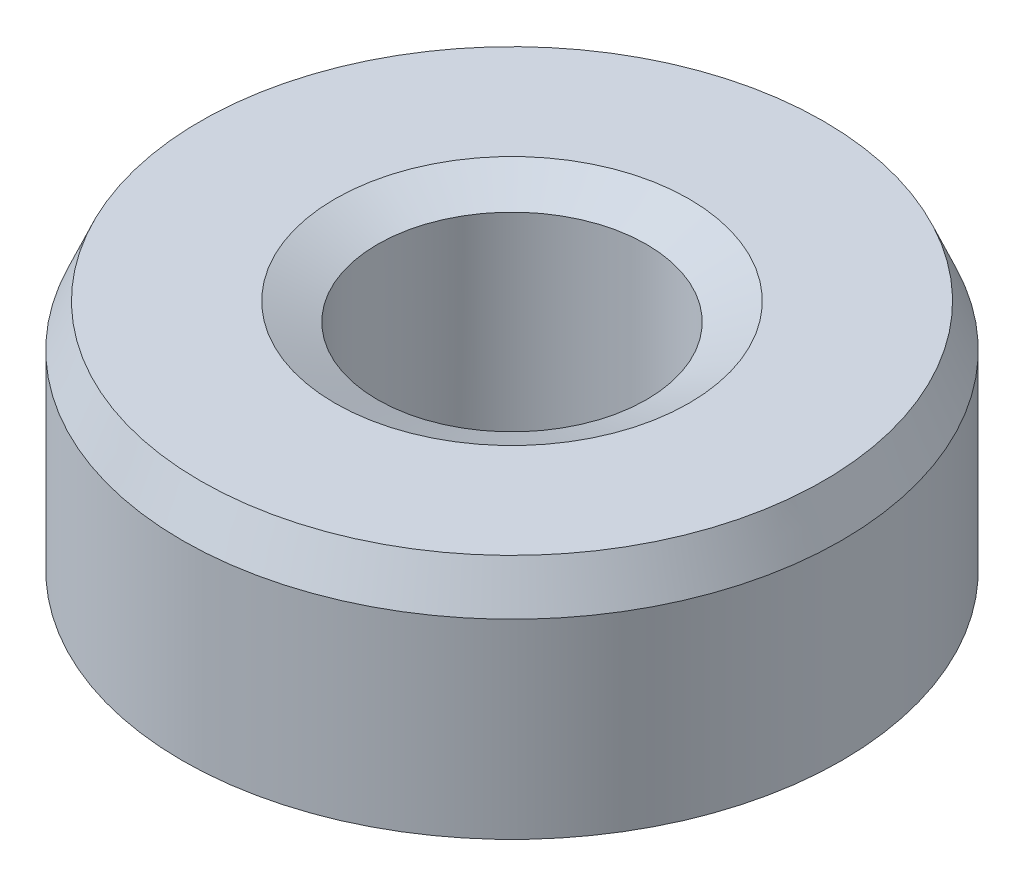
ISO-10303-21;
HEADER;
FILE_DESCRIPTION(('STEP AP214'),'2;1');
FILE_NAME('part.step','',(''),(''),'','','');
FILE_SCHEMA(('AUTOMOTIVE_DESIGN { 1 0 10303 214 1 1 1 1 }'));
ENDSEC;
DATA;
#1=APPLICATION_CONTEXT('core data for automotive mechanical design processes');
#2=APPLICATION_PROTOCOL_DEFINITION('international standard','automotive_design',2000,#1);
#3=PRODUCT_CONTEXT('',#1,'mechanical');
#4=PRODUCT('Part','Part','',(#3));
#5=PRODUCT_RELATED_PRODUCT_CATEGORY('part','',(#4));
#6=PRODUCT_DEFINITION_FORMATION('','',#4);
#7=PRODUCT_DEFINITION_CONTEXT('part definition',#1,'design');
#8=PRODUCT_DEFINITION('design','',#6,#7);
#9=PRODUCT_DEFINITION_SHAPE('','',#8);
#10=(LENGTH_UNIT() NAMED_UNIT(*) SI_UNIT(.MILLI.,.METRE.));
#11=(NAMED_UNIT(*) PLANE_ANGLE_UNIT() SI_UNIT($,.RADIAN.));
#12=(NAMED_UNIT(*) SI_UNIT($,.STERADIAN.) SOLID_ANGLE_UNIT());
#13=UNCERTAINTY_MEASURE_WITH_UNIT(LENGTH_MEASURE(1.E-05),#10,'distance_accuracy_value','');
#14=(GEOMETRIC_REPRESENTATION_CONTEXT(3) GLOBAL_UNCERTAINTY_ASSIGNED_CONTEXT((#13)) GLOBAL_UNIT_ASSIGNED_CONTEXT((#10,
#11,#12)) REPRESENTATION_CONTEXT('',''));
#15=CARTESIAN_POINT('',(0.,0.,0.));
#16=DIRECTION('',(0.,0.,1.));
#17=DIRECTION('',(1.,0.,0.));
#18=AXIS2_PLACEMENT_3D('',#15,#16,#17);
#19=CARTESIAN_POINT('',(0.,5.71659606913814,0.));
#20=DIRECTION('',(0.,-1.,0.));
#21=DIRECTION('',(0.,0.,-1.));
#22=AXIS2_PLACEMENT_3D('',#19,#20,#21);
#23=CYLINDRICAL_SURFACE('',#22,7.5);
#24=CARTESIAN_POINT('',(0.,0.412879435065678,0.));
#25=DIRECTION('',(0.,1.,0.));
#26=DIRECTION('',(0.,0.,1.));
#27=AXIS2_PLACEMENT_3D('',#24,#25,#26);
#28=CIRCLE('',#27,7.5);
#29=CARTESIAN_POINT('',(0.,0.412879435065678,-7.5));
#30=VERTEX_POINT('',#29);
#31=EDGE_CURVE('E10',#30,#30,#28,.T.);
#32=CARTESIAN_POINT('',(0.,4.75047972856687,0.));
#33=DIRECTION('',(0.,1.,0.));
#34=DIRECTION('',(0.,0.,1.));
#35=AXIS2_PLACEMENT_3D('',#32,#33,#34);
#36=CIRCLE('',#35,7.5);
#37=CARTESIAN_POINT('',(0.,4.75047972856687,-7.5));
#38=VERTEX_POINT('',#37);
#39=EDGE_CURVE('E50',#38,#38,#36,.F.);
#40=CARTESIAN_POINT('',(0.,0.412879435065678,-7.5));
#41=CARTESIAN_POINT('',(0.,0.458062771456315,-7.5));
#42=CARTESIAN_POINT('',(0.,0.503246107846952,-7.5));
#43=CARTESIAN_POINT('',(0.,0.593612780628227,-7.5));
#44=CARTESIAN_POINT('',(0.,0.638796117018865,-7.5));
#45=CARTESIAN_POINT('',(0.,0.72916278980014,-7.5));
#46=CARTESIAN_POINT('',(0.,0.774346126190777,-7.5));
#47=CARTESIAN_POINT('',(0.,0.864712798972052,-7.5));
#48=CARTESIAN_POINT('',(0.,0.909896135362689,-7.5));
#49=CARTESIAN_POINT('',(0.,1.00026280814396,-7.5));
#50=CARTESIAN_POINT('',(0.,1.0454461445346,-7.5));
#51=CARTESIAN_POINT('',(0.,1.13581281731588,-7.5));
#52=CARTESIAN_POINT('',(0.,1.18099615370651,-7.5));
#53=CARTESIAN_POINT('',(0.,1.27136282648779,-7.5));
#54=CARTESIAN_POINT('',(0.,1.31654616287843,-7.5));
#55=CARTESIAN_POINT('',(0.,1.4069128356597,-7.5));
#56=CARTESIAN_POINT('',(0.,1.45209617205034,-7.5));
#57=CARTESIAN_POINT('',(0.,1.54246284483161,-7.5));
#58=CARTESIAN_POINT('',(0.,1.58764618122225,-7.5));
#59=CARTESIAN_POINT('',(0.,1.67801285400352,-7.5));
#60=CARTESIAN_POINT('',(0.,1.72319619039416,-7.5));
#61=CARTESIAN_POINT('',(0.,1.81356286317544,-7.5));
#62=CARTESIAN_POINT('',(0.,1.85874619956607,-7.5));
#63=CARTESIAN_POINT('',(0.,1.94911287234735,-7.5));
#64=CARTESIAN_POINT('',(0.,1.99429620873799,-7.5));
#65=CARTESIAN_POINT('',(0.,2.08466288151926,-7.5));
#66=CARTESIAN_POINT('',(0.,2.1298462179099,-7.5));
#67=CARTESIAN_POINT('',(0.,2.22021289069117,-7.5));
#68=CARTESIAN_POINT('',(0.,2.26539622708181,-7.5));
#69=CARTESIAN_POINT('',(0.,2.35576289986308,-7.5));
#70=CARTESIAN_POINT('',(0.,2.40094623625372,-7.5));
#71=CARTESIAN_POINT('',(0.,2.491312909035,-7.5));
#72=CARTESIAN_POINT('',(0.,2.53649624542563,-7.5));
#73=CARTESIAN_POINT('',(0.,2.62686291820691,-7.5));
#74=CARTESIAN_POINT('',(0.,2.67204625459755,-7.5));
#75=CARTESIAN_POINT('',(0.,2.76241292737882,-7.5));
#76=CARTESIAN_POINT('',(0.,2.80759626376946,-7.5));
#77=CARTESIAN_POINT('',(0.,2.89796293655073,-7.5));
#78=CARTESIAN_POINT('',(0.,2.94314627294137,-7.5));
#79=CARTESIAN_POINT('',(0.,3.03351294572265,-7.5));
#80=CARTESIAN_POINT('',(0.,3.07869628211328,-7.5));
#81=CARTESIAN_POINT('',(0.,3.16906295489456,-7.5));
#82=CARTESIAN_POINT('',(0.,3.2142462912852,-7.5));
#83=CARTESIAN_POINT('',(0.,3.30461296406647,-7.5));
#84=CARTESIAN_POINT('',(0.,3.34979630045711,-7.5));
#85=CARTESIAN_POINT('',(0.,3.44016297323838,-7.5));
#86=CARTESIAN_POINT('',(0.,3.48534630962902,-7.5));
#87=CARTESIAN_POINT('',(0.,3.57571298241029,-7.5));
#88=CARTESIAN_POINT('',(0.,3.62089631880093,-7.5));
#89=CARTESIAN_POINT('',(0.,3.71126299158221,-7.5));
#90=CARTESIAN_POINT('',(0.,3.75644632797284,-7.5));
#91=CARTESIAN_POINT('',(0.,3.84681300075412,-7.5));
#92=CARTESIAN_POINT('',(0.,3.89199633714476,-7.5));
#93=CARTESIAN_POINT('',(0.,3.98236300992603,-7.5));
#94=CARTESIAN_POINT('',(0.,4.02754634631667,-7.5));
#95=CARTESIAN_POINT('',(0.,4.11791301909794,-7.5));
#96=CARTESIAN_POINT('',(0.,4.16309635548858,-7.5));
#97=CARTESIAN_POINT('',(0.,4.25346302826985,-7.5));
#98=CARTESIAN_POINT('',(0.,4.29864636466049,-7.5));
#99=CARTESIAN_POINT('',(0.,4.38901303744177,-7.5));
#100=CARTESIAN_POINT('',(0.,4.4341963738324,-7.5));
#101=CARTESIAN_POINT('',(0.,4.52456304661368,-7.5));
#102=CARTESIAN_POINT('',(0.,4.56974638300432,-7.5));
#103=CARTESIAN_POINT('',(0.,4.66011305578559,-7.5));
#104=CARTESIAN_POINT('',(0.,4.70529639217623,-7.5));
#105=CARTESIAN_POINT('',(0.,4.75047972856687,-7.5));
#106=B_SPLINE_CURVE_WITH_KNOTS('',3,(#40,#41,#42,#43,#44,#45,#46,#47,#48,#49,#50,#51,#52,#53,
#54,#55,#56,#57,#58,#59,#60,#61,#62,#63,#64,#65,#66,#67,#68,#69,#70,#71,#72,#73,#74,#75,#76,#77,
#78,#79,#80,#81,#82,#83,#84,#85,#86,#87,#88,#89,#90,#91,#92,#93,#94,#95,#96,#97,#98,#99,#100,
#101,#102,#103,#104,#105),.UNSPECIFIED.,.F.,.F.,(4,2,2,2,2,2,2,2,2,2,2,2,2,2,2,2,2,2,2,2,2,2,2,
2,2,2,2,2,2,2,2,2,4),(0.,0.135550009171912,0.271100018343825,0.406650027515737,
0.542200036687649,0.67775004585956,0.813300055031473,0.948850064203385,1.0844000733753,
1.21995008254721,1.35550009171912,1.49105010089103,1.62660011006295,1.76215011923486,
1.89770012840677,2.03325013757868,2.16880014675059,2.30435015592251,2.43990016509442,
2.57545017426633,2.71100018343824,2.84655019261016,2.98210020178207,3.11765021095398,
3.25320022012589,3.3887502292978,3.52430023846972,3.65985024764163,3.79540025681354,
3.93095026598545,4.06650027515736,4.20205028432928,4.33760029350119),.UNSPECIFIED.);
#107=EDGE_CURVE('BSEAM39',#30,#38,#106,.T.);
#108=ORIENTED_EDGE('',*,*,#31,.T.);
#109=ORIENTED_EDGE('',*,*,#39,.T.);
#110=ORIENTED_EDGE('',*,*,#107,.T.);
#111=ORIENTED_EDGE('',*,*,#107,.F.);
#112=EDGE_LOOP('',(#108,#110,#109,#111));
#113=FACE_BOUND('',#112,.T.);
#114=ADVANCED_FACE('F39',(#113),#23,.T.);
#115=CARTESIAN_POINT('',(0.,5.71659606913814,0.));
#116=DIRECTION('',(0.,1.,0.));
#117=DIRECTION('',(0.,0.,1.));
#118=AXIS2_PLACEMENT_3D('',#115,#116,#117);
#119=PLANE('',#118);
#120=CARTESIAN_POINT('',(0.,5.71659606913814,0.));
#121=DIRECTION('',(0.,1.,0.));
#122=DIRECTION('',(0.,0.,1.));
#123=AXIS2_PLACEMENT_3D('',#120,#121,#122);
#124=CIRCLE('',#123,4.02668549359805);
#125=CARTESIAN_POINT('',(0.,5.71659606913814,4.02668549359805));
#126=VERTEX_POINT('',#125);
#127=EDGE_CURVE('E58',#126,#126,#124,.F.);
#128=ORIENTED_EDGE('',*,*,#127,.T.);
#129=EDGE_LOOP('',(#128));
#130=FACE_BOUND('',#129,.T.);
#131=CARTESIAN_POINT('',(0.,5.71659606913814,0.));
#132=DIRECTION('',(0.,1.,0.));
#133=DIRECTION('',(0.,0.,1.));
#134=AXIS2_PLACEMENT_3D('',#131,#132,#133);
#135=CIRCLE('',#134,7.08712056493434);
#136=CARTESIAN_POINT('',(0.,5.71659606913814,7.08712056493434));
#137=VERTEX_POINT('',#136);
#138=EDGE_CURVE('E61',#137,#137,#135,.T.);
#139=ORIENTED_EDGE('',*,*,#138,.T.);
#140=EDGE_LOOP('',(#139));
#141=FACE_BOUND('',#140,.T.);
#142=ADVANCED_FACE('F88',(#130,#141),#119,.T.);
#143=CARTESIAN_POINT('',(0.,0.,0.));
#144=DIRECTION('',(0.,1.,0.));
#145=DIRECTION('',(0.,0.,1.));
#146=AXIS2_PLACEMENT_3D('',#143,#144,#145);
#147=PLANE('',#146);
#148=CARTESIAN_POINT('',(0.,0.,0.));
#149=DIRECTION('',(0.,1.,0.));
#150=DIRECTION('',(0.,0.,1.));
#151=AXIS2_PLACEMENT_3D('',#148,#149,#150);
#152=CIRCLE('',#151,3.47344858809238);
#153=CARTESIAN_POINT('',(0.,0.,3.47344858809238));
#154=VERTEX_POINT('',#153);
#155=EDGE_CURVE('E51',#154,#154,#152,.T.);
#156=ORIENTED_EDGE('',*,*,#155,.T.);
#157=EDGE_LOOP('',(#156));
#158=FACE_BOUND('',#157,.T.);
#159=CARTESIAN_POINT('',(0.,0.,0.));
#160=DIRECTION('',(0.,1.,0.));
#161=DIRECTION('',(0.,0.,1.));
#162=AXIS2_PLACEMENT_3D('',#159,#160,#161);
#163=CIRCLE('',#162,6.53388365942867);
#164=CARTESIAN_POINT('',(0.,0.,6.53388365942867));
#165=VERTEX_POINT('',#164);
#166=EDGE_CURVE('E54',#165,#165,#163,.F.);
#167=ORIENTED_EDGE('',*,*,#166,.T.);
#168=EDGE_LOOP('',(#167));
#169=FACE_BOUND('',#168,.T.);
#170=ADVANCED_FACE('F83',(#158,#169),#147,.F.);
#171=CARTESIAN_POINT('',(0.,5.71659606913814,0.));
#172=DIRECTION('',(0.,-1.,0.));
#173=DIRECTION('',(0.,0.,-1.));
#174=AXIS2_PLACEMENT_3D('',#171,#172,#173);
#175=CYLINDRICAL_SURFACE('',#174,3.06056915302673);
#176=CARTESIAN_POINT('',(0.,5.30371663407246,0.));
#177=DIRECTION('',(0.,1.,0.));
#178=DIRECTION('',(0.,0.,1.));
#179=AXIS2_PLACEMENT_3D('',#176,#177,#178);
#180=CIRCLE('',#179,3.06056915302673);
#181=CARTESIAN_POINT('',(0.,5.30371663407246,-3.06056915302673));
#182=VERTEX_POINT('',#181);
#183=EDGE_CURVE('E67',#182,#182,#180,.T.);
#184=CARTESIAN_POINT('',(0.,0.966116340571286,0.));
#185=DIRECTION('',(0.,1.,0.));
#186=DIRECTION('',(0.,0.,1.));
#187=AXIS2_PLACEMENT_3D('',#184,#185,#186);
#188=CIRCLE('',#187,3.06056915302673);
#189=CARTESIAN_POINT('',(0.,0.966116340571286,-3.06056915302673));
#190=VERTEX_POINT('',#189);
#191=EDGE_CURVE('E69',#190,#190,#188,.F.);
#192=CARTESIAN_POINT('',(0.,5.30371663407246,-3.06056915302673));
#193=CARTESIAN_POINT('',(0.,5.25853329768182,-3.06056915302673));
#194=CARTESIAN_POINT('',(0.,5.21334996129119,-3.06056915302673));
#195=CARTESIAN_POINT('',(0.,5.12298328850991,-3.06056915302673));
#196=CARTESIAN_POINT('',(0.,5.07779995211927,-3.06056915302673));
#197=CARTESIAN_POINT('',(0.,4.987433279338,-3.06056915302673));
#198=CARTESIAN_POINT('',(0.,4.94224994294736,-3.06056915302673));
#199=CARTESIAN_POINT('',(0.,4.85188327016609,-3.06056915302673));
#200=CARTESIAN_POINT('',(0.,4.80669993377545,-3.06056915302673));
#201=CARTESIAN_POINT('',(0.,4.71633326099418,-3.06056915302673));
#202=CARTESIAN_POINT('',(0.,4.67114992460354,-3.06056915302673));
#203=CARTESIAN_POINT('',(0.,4.58078325182226,-3.06056915302673));
#204=CARTESIAN_POINT('',(0.,4.53559991543163,-3.06056915302673));
#205=CARTESIAN_POINT('',(0.,4.44523324265035,-3.06056915302673));
#206=CARTESIAN_POINT('',(0.,4.40004990625972,-3.06056915302673));
#207=CARTESIAN_POINT('',(0.,4.30968323347844,-3.06056915302673));
#208=CARTESIAN_POINT('',(0.,4.2644998970878,-3.06056915302673));
#209=CARTESIAN_POINT('',(0.,4.17413322430653,-3.06056915302673));
#210=CARTESIAN_POINT('',(0.,4.12894988791589,-3.06056915302673));
#211=CARTESIAN_POINT('',(0.,4.03858321513462,-3.06056915302673));
#212=CARTESIAN_POINT('',(0.,3.99339987874398,-3.06056915302673));
#213=CARTESIAN_POINT('',(0.,3.90303320596271,-3.06056915302673));
#214=CARTESIAN_POINT('',(0.,3.85784986957207,-3.06056915302673));
#215=CARTESIAN_POINT('',(0.,3.76748319679079,-3.06056915302673));
#216=CARTESIAN_POINT('',(0.,3.72229986040016,-3.06056915302673));
#217=CARTESIAN_POINT('',(0.,3.63193318761888,-3.06056915302673));
#218=CARTESIAN_POINT('',(0.,3.58674985122825,-3.06056915302673));
#219=CARTESIAN_POINT('',(0.,3.49638317844697,-3.06056915302673));
#220=CARTESIAN_POINT('',(0.,3.45119984205633,-3.06056915302673));
#221=CARTESIAN_POINT('',(0.,3.36083316927506,-3.06056915302673));
#222=CARTESIAN_POINT('',(0.,3.31564983288442,-3.06056915302673));
#223=CARTESIAN_POINT('',(0.,3.22528316010315,-3.06056915302673));
#224=CARTESIAN_POINT('',(0.,3.18009982371251,-3.06056915302673));
#225=CARTESIAN_POINT('',(0.,3.08973315093124,-3.06056915302673));
#226=CARTESIAN_POINT('',(0.,3.0445498145406,-3.06056915302673));
#227=CARTESIAN_POINT('',(0.,2.95418314175932,-3.06056915302673));
#228=CARTESIAN_POINT('',(0.,2.90899980536869,-3.06056915302673));
#229=CARTESIAN_POINT('',(0.,2.81863313258741,-3.06056915302673));
#230=CARTESIAN_POINT('',(0.,2.77344979619677,-3.06056915302673));
#231=CARTESIAN_POINT('',(0.,2.6830831234155,-3.06056915302673));
#232=CARTESIAN_POINT('',(0.,2.63789978702486,-3.06056915302673));
#233=CARTESIAN_POINT('',(0.,2.54753311424359,-3.06056915302673));
#234=CARTESIAN_POINT('',(0.,2.50234977785295,-3.06056915302673));
#235=CARTESIAN_POINT('',(0.,2.41198310507168,-3.06056915302673));
#236=CARTESIAN_POINT('',(0.,2.36679976868104,-3.06056915302673));
#237=CARTESIAN_POINT('',(0.,2.27643309589976,-3.06056915302673));
#238=CARTESIAN_POINT('',(0.,2.23124975950913,-3.06056915302673));
#239=CARTESIAN_POINT('',(0.,2.14088308672785,-3.06056915302673));
#240=CARTESIAN_POINT('',(0.,2.09569975033722,-3.06056915302673));
#241=CARTESIAN_POINT('',(0.,2.00533307755594,-3.06056915302673));
#242=CARTESIAN_POINT('',(0.,1.9601497411653,-3.06056915302673));
#243=CARTESIAN_POINT('',(0.,1.86978306838403,-3.06056915302673));
#244=CARTESIAN_POINT('',(0.,1.82459973199339,-3.06056915302673));
#245=CARTESIAN_POINT('',(0.,1.73423305921212,-3.06056915302673));
#246=CARTESIAN_POINT('',(0.,1.68904972282148,-3.06056915302673));
#247=CARTESIAN_POINT('',(0.,1.59868305004021,-3.06056915302673));
#248=CARTESIAN_POINT('',(0.,1.55349971364957,-3.06056915302673));
#249=CARTESIAN_POINT('',(0.,1.46313304086829,-3.06056915302673));
#250=CARTESIAN_POINT('',(0.,1.41794970447766,-3.06056915302673));
#251=CARTESIAN_POINT('',(0.,1.32758303169638,-3.06056915302673));
#252=CARTESIAN_POINT('',(0.,1.28239969530575,-3.06056915302673));
#253=CARTESIAN_POINT('',(0.,1.19203302252447,-3.06056915302673));
#254=CARTESIAN_POINT('',(0.,1.14684968613383,-3.06056915302673));
#255=CARTESIAN_POINT('',(0.,1.05648301335256,-3.06056915302673));
#256=CARTESIAN_POINT('',(0.,1.01129967696192,-3.06056915302673));
#257=CARTESIAN_POINT('',(0.,0.966116340571286,-3.06056915302673));
#258=B_SPLINE_CURVE_WITH_KNOTS('',3,(#192,#193,#194,#195,#196,#197,#198,#199,#200,#201,#202,
#203,#204,#205,#206,#207,#208,#209,#210,#211,#212,#213,#214,#215,#216,#217,#218,#219,#220,#221,
#222,#223,#224,#225,#226,#227,#228,#229,#230,#231,#232,#233,#234,#235,#236,#237,#238,#239,#240,
#241,#242,#243,#244,#245,#246,#247,#248,#249,#250,#251,#252,#253,#254,#255,#256,#257),
.UNSPECIFIED.,.F.,.F.,(4,2,2,2,2,2,2,2,2,2,2,2,2,2,2,2,2,2,2,2,2,2,2,2,2,2,2,2,2,2,2,2,4),(0.,
0.135550009171912,0.271100018343824,0.406650027515735,0.542200036687647,0.677750045859559,
0.813300055031471,0.948850064203382,1.08440007337529,1.21995008254721,1.35550009171912,
1.49105010089103,1.62660011006294,1.76215011923485,1.89770012840676,2.03325013757868,
2.16880014675059,2.3043501559225,2.43990016509441,2.57545017426632,2.71100018343823,
2.84655019261015,2.98210020178206,3.11765021095397,3.25320022012588,3.38875022929779,
3.5243002384697,3.65985024764162,3.79540025681353,3.93095026598544,4.06650027515735,
4.20205028432926,4.33760029350117),.UNSPECIFIED.);
#259=EDGE_CURVE('BSEAM71',#182,#190,#258,.T.);
#260=ORIENTED_EDGE('',*,*,#183,.T.);
#261=ORIENTED_EDGE('',*,*,#191,.T.);
#262=ORIENTED_EDGE('',*,*,#259,.T.);
#263=ORIENTED_EDGE('',*,*,#259,.F.);
#264=EDGE_LOOP('',(#260,#262,#261,#263));
#265=FACE_BOUND('',#264,.T.);
#266=ADVANCED_FACE('F71',(#265),#175,.F.);
#267=CARTESIAN_POINT('',(0.,5.30371663407246,0.));
#268=DIRECTION('',(0.,1.,0.));
#269=DIRECTION('',(0.,0.,1.));
#270=AXIS2_PLACEMENT_3D('',#267,#268,#269);
#271=CONICAL_SURFACE('',#270,3.06056915302673,1.16692847625113);
#272=ORIENTED_EDGE('',*,*,#127,.F.);
#273=EDGE_LOOP('',(#272));
#274=FACE_BOUND('',#273,.T.);
#275=ORIENTED_EDGE('',*,*,#183,.F.);
#276=EDGE_LOOP('',(#275));
#277=FACE_BOUND('',#276,.T.);
#278=ADVANCED_FACE('F77',(#274,#277),#271,.F.);
#279=CARTESIAN_POINT('',(0.,0.,0.));
#280=DIRECTION('',(0.,-1.,0.));
#281=DIRECTION('',(0.,0.,-1.));
#282=AXIS2_PLACEMENT_3D('',#279,#280,#281);
#283=CONICAL_SURFACE('',#282,3.47344858809238,0.403867850543763);
#284=ORIENTED_EDGE('',*,*,#191,.F.);
#285=EDGE_LOOP('',(#284));
#286=FACE_BOUND('',#285,.T.);
#287=ORIENTED_EDGE('',*,*,#155,.F.);
#288=EDGE_LOOP('',(#287));
#289=FACE_BOUND('',#288,.T.);
#290=ADVANCED_FACE('F73',(#286,#289),#283,.F.);
#291=CARTESIAN_POINT('',(0.,0.412879435065678,0.));
#292=DIRECTION('',(0.,1.,0.));
#293=DIRECTION('',(0.,0.,1.));
#294=AXIS2_PLACEMENT_3D('',#291,#292,#293);
#295=CONICAL_SURFACE('',#294,7.5,1.16692847625113);
#296=ORIENTED_EDGE('',*,*,#166,.F.);
#297=EDGE_LOOP('',(#296));
#298=FACE_BOUND('',#297,.T.);
#299=ORIENTED_EDGE('',*,*,#31,.F.);
#300=EDGE_LOOP('',(#299));
#301=FACE_BOUND('',#300,.T.);
#302=ADVANCED_FACE('F76',(#298,#301),#295,.T.);
#303=CARTESIAN_POINT('',(0.,5.71659606913814,0.));
#304=DIRECTION('',(0.,-1.,0.));
#305=DIRECTION('',(0.,0.,-1.));
#306=AXIS2_PLACEMENT_3D('',#303,#304,#305);
#307=CONICAL_SURFACE('',#306,7.08712056493434,0.403867850543765);
#308=ORIENTED_EDGE('',*,*,#39,.F.);
#309=EDGE_LOOP('',(#308));
#310=FACE_BOUND('',#309,.T.);
#311=ORIENTED_EDGE('',*,*,#138,.F.);
#312=EDGE_LOOP('',(#311));
#313=FACE_BOUND('',#312,.T.);
#314=ADVANCED_FACE('F45',(#310,#313),#307,.T.);
#315=CLOSED_SHELL('',(#114,#142,#170,#266,#278,#290,#302,#314));
#316=MANIFOLD_SOLID_BREP('B2',#315);
#317=ADVANCED_BREP_SHAPE_REPRESENTATION('',(#18,#316),#14);
#318=SHAPE_DEFINITION_REPRESENTATION(#9,#317);
ENDSEC;
END-ISO-10303-21;
